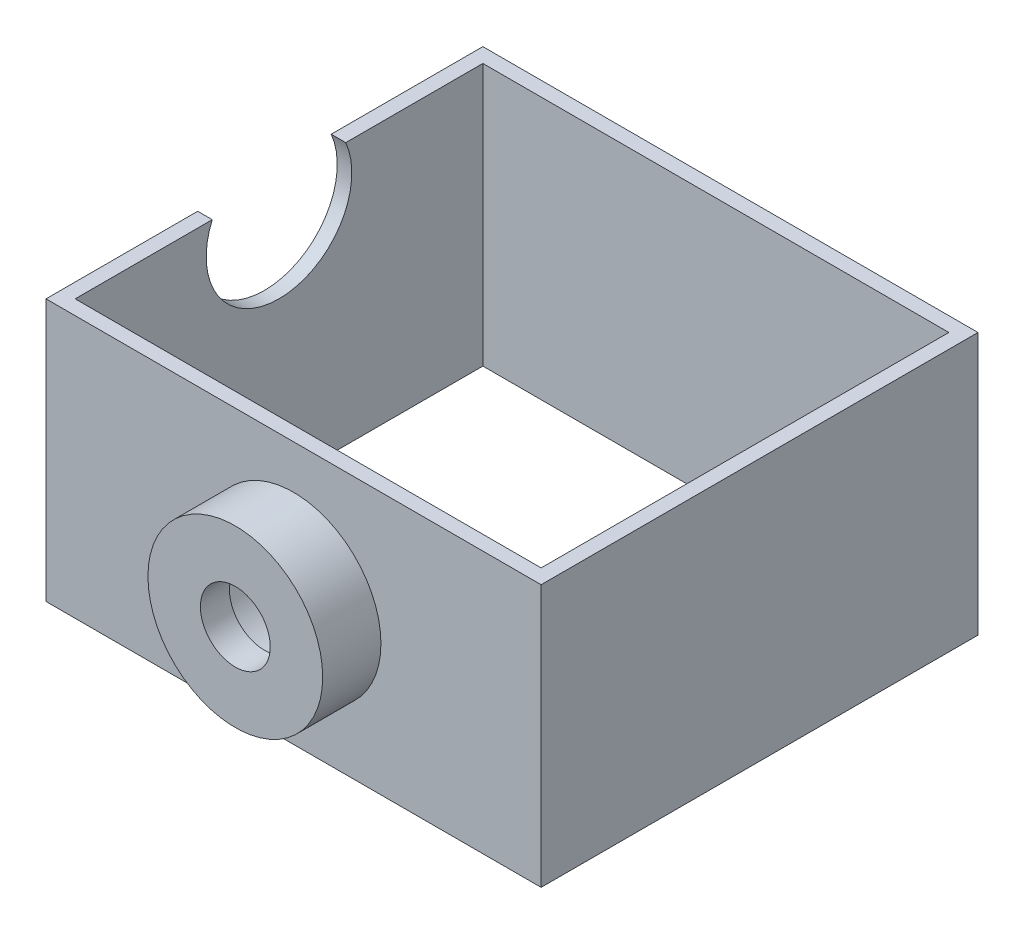
ISO-10303-21;
HEADER;
FILE_DESCRIPTION(('STEP AP214'),'2;1');
FILE_NAME('part.step','',(''),(''),'','','');
FILE_SCHEMA(('AUTOMOTIVE_DESIGN { 1 0 10303 214 1 1 1 1 }'));
ENDSEC;
DATA;
#1=APPLICATION_CONTEXT('core data for automotive mechanical design processes');
#2=APPLICATION_PROTOCOL_DEFINITION('international standard','automotive_design',2000,#1);
#3=PRODUCT_CONTEXT('',#1,'mechanical');
#4=PRODUCT('Part','Part','',(#3));
#5=PRODUCT_RELATED_PRODUCT_CATEGORY('part','',(#4));
#6=PRODUCT_DEFINITION_FORMATION('','',#4);
#7=PRODUCT_DEFINITION_CONTEXT('part definition',#1,'design');
#8=PRODUCT_DEFINITION('design','',#6,#7);
#9=PRODUCT_DEFINITION_SHAPE('','',#8);
#10=(LENGTH_UNIT() NAMED_UNIT(*) SI_UNIT(.MILLI.,.METRE.));
#11=(NAMED_UNIT(*) PLANE_ANGLE_UNIT() SI_UNIT($,.RADIAN.));
#12=(NAMED_UNIT(*) SI_UNIT($,.STERADIAN.) SOLID_ANGLE_UNIT());
#13=UNCERTAINTY_MEASURE_WITH_UNIT(LENGTH_MEASURE(1.E-05),#10,'distance_accuracy_value','');
#14=(GEOMETRIC_REPRESENTATION_CONTEXT(3) GLOBAL_UNCERTAINTY_ASSIGNED_CONTEXT((#13)) GLOBAL_UNIT_ASSIGNED_CONTEXT((#10,
#11,#12)) REPRESENTATION_CONTEXT('',''));
#15=CARTESIAN_POINT('',(0.,0.,0.));
#16=DIRECTION('',(0.,0.,1.));
#17=DIRECTION('',(1.,0.,0.));
#18=AXIS2_PLACEMENT_3D('',#15,#16,#17);
#19=CARTESIAN_POINT('',(0.,0.,-75.001));
#20=DIRECTION('',(0.,0.,1.));
#21=DIRECTION('',(1.,0.,0.));
#22=AXIS2_PLACEMENT_3D('',#19,#20,#21);
#23=CYLINDRICAL_SURFACE('',#22,6.);
#24=CARTESIAN_POINT('',(0.,0.,10.));
#25=DIRECTION('',(0.,0.,1.));
#26=DIRECTION('',(1.,0.,0.));
#27=AXIS2_PLACEMENT_3D('',#24,#25,#26);
#28=CIRCLE('',#27,6.);
#29=CARTESIAN_POINT('',(6.,0.,10.));
#30=VERTEX_POINT('',#29);
#31=EDGE_CURVE('E212',#30,#30,#28,.T.);
#32=ORIENTED_EDGE('',*,*,#31,.T.);
#33=EDGE_LOOP('',(#32));
#34=FACE_BOUND('',#33,.T.);
#35=CARTESIAN_POINT('',(0.,0.,5.00000000000002));
#36=DIRECTION('',(0.,0.,-1.));
#37=DIRECTION('',(-1.,0.,0.));
#38=AXIS2_PLACEMENT_3D('',#35,#36,#37);
#39=CIRCLE('',#38,6.);
#40=CARTESIAN_POINT('',(-6.,0.,5.00000000000002));
#41=VERTEX_POINT('',#40);
#42=EDGE_CURVE('E37',#41,#41,#39,.F.);
#43=ORIENTED_EDGE('',*,*,#42,.F.);
#44=EDGE_LOOP('',(#43));
#45=FACE_BOUND('',#44,.T.);
#46=ADVANCED_FACE('F33',(#34,#45),#23,.F.);
#47=CARTESIAN_POINT('',(0.,0.,10.));
#48=DIRECTION('',(0.,0.,-1.));
#49=DIRECTION('',(-1.,0.,0.));
#50=AXIS2_PLACEMENT_3D('',#47,#48,#49);
#51=CYLINDRICAL_SURFACE('',#50,15.);
#52=CARTESIAN_POINT('',(0.,0.,10.));
#53=DIRECTION('',(0.,0.,1.));
#54=DIRECTION('',(1.,0.,0.));
#55=AXIS2_PLACEMENT_3D('',#52,#53,#54);
#56=CIRCLE('',#55,15.);
#57=CARTESIAN_POINT('',(15.,0.,10.));
#58=VERTEX_POINT('',#57);
#59=EDGE_CURVE('E11',#58,#58,#56,.T.);
#60=ORIENTED_EDGE('',*,*,#59,.F.);
#61=EDGE_LOOP('',(#60));
#62=FACE_BOUND('',#61,.T.);
#63=CARTESIAN_POINT('',(0.,0.,0.));
#64=DIRECTION('',(0.,0.,1.));
#65=DIRECTION('',(1.,0.,0.));
#66=AXIS2_PLACEMENT_3D('',#63,#64,#65);
#67=CIRCLE('',#66,15.);
#68=CARTESIAN_POINT('',(15.,0.,0.));
#69=VERTEX_POINT('',#68);
#70=EDGE_CURVE('E42',#69,#69,#67,.T.);
#71=ORIENTED_EDGE('',*,*,#70,.T.);
#72=EDGE_LOOP('',(#71));
#73=FACE_BOUND('',#72,.T.);
#74=ADVANCED_FACE('F35',(#62,#73),#51,.T.);
#75=CARTESIAN_POINT('',(0.,0.,10.));
#76=DIRECTION('',(0.,0.,1.));
#77=DIRECTION('',(1.,0.,0.));
#78=AXIS2_PLACEMENT_3D('',#75,#76,#77);
#79=PLANE('',#78);
#80=ORIENTED_EDGE('',*,*,#31,.F.);
#81=EDGE_LOOP('',(#80));
#82=FACE_BOUND('',#81,.T.);
#83=ORIENTED_EDGE('',*,*,#59,.T.);
#84=EDGE_LOOP('',(#83));
#85=FACE_BOUND('',#84,.T.);
#86=ADVANCED_FACE('F253',(#82,#85),#79,.T.);
#87=CARTESIAN_POINT('',(-42.5,-22.5,-75.));
#88=DIRECTION('',(1.,0.,0.));
#89=DIRECTION('',(0.,0.,-1.));
#90=AXIS2_PLACEMENT_3D('',#87,#88,#89);
#91=PLANE('',#90);
#92=DIRECTION('',(0.,0.,1.));
#93=VECTOR('',#92,1.);
#94=CARTESIAN_POINT('',(-42.5,22.5,-75.));
#95=LINE('',#94,#93);
#96=CARTESIAN_POINT('',(-42.5,22.5,-26.0435607626104));
#97=VERTEX_POINT('',#96);
#98=CARTESIAN_POINT('',(-42.5,22.5,0.));
#99=VERTEX_POINT('',#98);
#100=EDGE_CURVE('E122',#97,#99,#95,.T.);
#101=ORIENTED_EDGE('',*,*,#100,.F.);
#102=CARTESIAN_POINT('',(-42.5,17.5,-37.5));
#103=DIRECTION('',(-1.,0.,0.));
#104=DIRECTION('',(0.,0.,1.));
#105=AXIS2_PLACEMENT_3D('',#102,#103,#104);
#106=CIRCLE('',#105,12.5);
#107=CARTESIAN_POINT('',(-42.5,22.5,-48.9564392373896));
#108=VERTEX_POINT('',#107);
#109=EDGE_CURVE('E110',#108,#97,#106,.T.);
#110=ORIENTED_EDGE('',*,*,#109,.F.);
#111=CARTESIAN_POINT('',(-42.5,22.5,-75.));
#112=VERTEX_POINT('',#111);
#113=EDGE_CURVE('E131',#112,#108,#95,.T.);
#114=ORIENTED_EDGE('',*,*,#113,.F.);
#115=DIRECTION('',(0.,1.,0.));
#116=VECTOR('',#115,1.);
#117=CARTESIAN_POINT('',(-42.5,-22.5,-75.));
#118=LINE('',#117,#116);
#119=CARTESIAN_POINT('',(-42.5,-22.5,-75.));
#120=VERTEX_POINT('',#119);
#121=EDGE_CURVE('E165',#120,#112,#118,.T.);
#122=ORIENTED_EDGE('',*,*,#121,.F.);
#123=DIRECTION('',(0.,0.,1.));
#124=VECTOR('',#123,1.);
#125=CARTESIAN_POINT('',(-42.5,-22.5,-75.));
#126=LINE('',#125,#124);
#127=CARTESIAN_POINT('',(-42.5,-22.5,0.));
#128=VERTEX_POINT('',#127);
#129=EDGE_CURVE('E166',#120,#128,#126,.T.);
#130=ORIENTED_EDGE('',*,*,#129,.T.);
#131=DIRECTION('',(0.,1.,0.));
#132=VECTOR('',#131,1.);
#133=CARTESIAN_POINT('',(-42.5,-22.5,0.));
#134=LINE('',#133,#132);
#135=EDGE_CURVE('E130',#128,#99,#134,.T.);
#136=ORIENTED_EDGE('',*,*,#135,.T.);
#137=EDGE_LOOP('',(#101,#110,#114,#122,#130,#136));
#138=FACE_BOUND('',#137,.T.);
#139=ADVANCED_FACE('F127',(#138),#91,.F.);
#140=CARTESIAN_POINT('',(42.5,22.5,-75.));
#141=DIRECTION('',(0.,-1.,0.));
#142=DIRECTION('',(0.,0.,-1.));
#143=AXIS2_PLACEMENT_3D('',#140,#141,#142);
#144=PLANE('',#143);
#145=DIRECTION('',(0.,0.,1.));
#146=VECTOR('',#145,1.);
#147=CARTESIAN_POINT('',(-40.,22.5,-2.49999999999997));
#148=LINE('',#147,#146);
#149=CARTESIAN_POINT('',(-40.,22.5,-26.0435607626104));
#150=VERTEX_POINT('',#149);
#151=CARTESIAN_POINT('',(-40.,22.5,-2.49999999999998));
#152=VERTEX_POINT('',#151);
#153=EDGE_CURVE('E57',#150,#152,#148,.T.);
#154=ORIENTED_EDGE('',*,*,#153,.F.);
#155=DIRECTION('',(-1.,0.,0.));
#156=VECTOR('',#155,1.);
#157=CARTESIAN_POINT('',(42.501,22.5,-26.0435607626104));
#158=LINE('',#157,#156);
#159=EDGE_CURVE('E50',#97,#150,#158,.F.);
#160=ORIENTED_EDGE('',*,*,#159,.F.);
#161=ORIENTED_EDGE('',*,*,#100,.T.);
#162=DIRECTION('',(1.,0.,0.));
#163=VECTOR('',#162,1.);
#164=CARTESIAN_POINT('',(42.5,22.5,0.));
#165=LINE('',#164,#163);
#166=CARTESIAN_POINT('',(42.5,22.5,0.));
#167=VERTEX_POINT('',#166);
#168=EDGE_CURVE('E151',#99,#167,#165,.T.);
#169=ORIENTED_EDGE('',*,*,#168,.T.);
#170=DIRECTION('',(0.,0.,1.));
#171=VECTOR('',#170,1.);
#172=CARTESIAN_POINT('',(42.5,22.5,-75.));
#173=LINE('',#172,#171);
#174=CARTESIAN_POINT('',(42.5,22.5,-75.));
#175=VERTEX_POINT('',#174);
#176=EDGE_CURVE('E132',#175,#167,#173,.T.);
#177=ORIENTED_EDGE('',*,*,#176,.F.);
#178=DIRECTION('',(1.,0.,0.));
#179=VECTOR('',#178,1.);
#180=CARTESIAN_POINT('',(42.5,22.5,-75.));
#181=LINE('',#180,#179);
#182=EDGE_CURVE('E178',#112,#175,#181,.T.);
#183=ORIENTED_EDGE('',*,*,#182,.F.);
#184=ORIENTED_EDGE('',*,*,#113,.T.);
#185=DIRECTION('',(-1.,0.,0.));
#186=VECTOR('',#185,1.);
#187=CARTESIAN_POINT('',(42.501,22.5,-48.9564392373896));
#188=LINE('',#187,#186);
#189=CARTESIAN_POINT('',(-40.,22.5,-48.9564392373896));
#190=VERTEX_POINT('',#189);
#191=EDGE_CURVE('E113',#190,#108,#188,.T.);
#192=ORIENTED_EDGE('',*,*,#191,.F.);
#193=CARTESIAN_POINT('',(-40.,22.5,-72.5));
#194=VERTEX_POINT('',#193);
#195=EDGE_CURVE('E201',#194,#190,#148,.T.);
#196=ORIENTED_EDGE('',*,*,#195,.F.);
#197=DIRECTION('',(-1.,0.,0.));
#198=VECTOR('',#197,1.);
#199=CARTESIAN_POINT('',(40.,22.5,-72.5));
#200=LINE('',#199,#198);
#201=CARTESIAN_POINT('',(40.,22.5,-72.5));
#202=VERTEX_POINT('',#201);
#203=EDGE_CURVE('E188',#202,#194,#200,.T.);
#204=ORIENTED_EDGE('',*,*,#203,.F.);
#205=DIRECTION('',(0.,0.,-1.));
#206=VECTOR('',#205,1.);
#207=CARTESIAN_POINT('',(40.,22.5,-2.49999999999998));
#208=LINE('',#207,#206);
#209=CARTESIAN_POINT('',(40.,22.5,-2.49999999999998));
#210=VERTEX_POINT('',#209);
#211=EDGE_CURVE('E195',#210,#202,#208,.T.);
#212=ORIENTED_EDGE('',*,*,#211,.F.);
#213=DIRECTION('',(1.,0.,0.));
#214=VECTOR('',#213,1.);
#215=CARTESIAN_POINT('',(40.,22.5,-2.49999999999998));
#216=LINE('',#215,#214);
#217=EDGE_CURVE('E198',#152,#210,#216,.T.);
#218=ORIENTED_EDGE('',*,*,#217,.F.);
#219=EDGE_LOOP('',(#154,#160,#161,#169,#177,#183,#184,#192,#196,#204,#212,#218));
#220=FACE_BOUND('',#219,.T.);
#221=ADVANCED_FACE('F121',(#220),#144,.F.);
#222=CARTESIAN_POINT('',(42.5,-22.5,-75.));
#223=DIRECTION('',(-1.,0.,0.));
#224=DIRECTION('',(0.,0.,1.));
#225=AXIS2_PLACEMENT_3D('',#222,#223,#224);
#226=PLANE('',#225);
#227=DIRECTION('',(0.,-1.,0.));
#228=VECTOR('',#227,1.);
#229=CARTESIAN_POINT('',(42.5,-22.5,0.));
#230=LINE('',#229,#228);
#231=CARTESIAN_POINT('',(42.5,-22.5,0.));
#232=VERTEX_POINT('',#231);
#233=EDGE_CURVE('E154',#167,#232,#230,.T.);
#234=ORIENTED_EDGE('',*,*,#233,.T.);
#235=DIRECTION('',(0.,0.,1.));
#236=VECTOR('',#235,1.);
#237=CARTESIAN_POINT('',(42.5,-22.5,-75.));
#238=LINE('',#237,#236);
#239=CARTESIAN_POINT('',(42.5,-22.5,-75.));
#240=VERTEX_POINT('',#239);
#241=EDGE_CURVE('E135',#240,#232,#238,.T.);
#242=ORIENTED_EDGE('',*,*,#241,.F.);
#243=DIRECTION('',(0.,-1.,0.));
#244=VECTOR('',#243,1.);
#245=CARTESIAN_POINT('',(42.5,-22.5,-75.));
#246=LINE('',#245,#244);
#247=EDGE_CURVE('E176',#175,#240,#246,.T.);
#248=ORIENTED_EDGE('',*,*,#247,.F.);
#249=ORIENTED_EDGE('',*,*,#176,.T.);
#250=EDGE_LOOP('',(#234,#242,#248,#249));
#251=FACE_BOUND('',#250,.T.);
#252=ADVANCED_FACE('F175',(#251),#226,.F.);
#253=CARTESIAN_POINT('',(42.5,-22.5,-75.));
#254=DIRECTION('',(0.,1.,0.));
#255=DIRECTION('',(0.,0.,1.));
#256=AXIS2_PLACEMENT_3D('',#253,#254,#255);
#257=PLANE('',#256);
#258=DIRECTION('',(1.,0.,0.));
#259=VECTOR('',#258,1.);
#260=CARTESIAN_POINT('',(40.,-22.5,-72.5));
#261=LINE('',#260,#259);
#262=CARTESIAN_POINT('',(-40.,-22.5,-72.5));
#263=VERTEX_POINT('',#262);
#264=CARTESIAN_POINT('',(40.,-22.5,-72.5));
#265=VERTEX_POINT('',#264);
#266=EDGE_CURVE('E207',#263,#265,#261,.T.);
#267=ORIENTED_EDGE('',*,*,#266,.F.);
#268=DIRECTION('',(0.,0.,-1.));
#269=VECTOR('',#268,1.);
#270=CARTESIAN_POINT('',(-40.,-22.5,-2.49999999999997));
#271=LINE('',#270,#269);
#272=CARTESIAN_POINT('',(-40.,-22.5,-2.49999999999997));
#273=VERTEX_POINT('',#272);
#274=EDGE_CURVE('E204',#273,#263,#271,.T.);
#275=ORIENTED_EDGE('',*,*,#274,.F.);
#276=DIRECTION('',(-1.,0.,0.));
#277=VECTOR('',#276,1.);
#278=CARTESIAN_POINT('',(40.,-22.5,-2.49999999999998));
#279=LINE('',#278,#277);
#280=CARTESIAN_POINT('',(40.,-22.5,-2.49999999999999));
#281=VERTEX_POINT('',#280);
#282=EDGE_CURVE('E152',#281,#273,#279,.T.);
#283=ORIENTED_EDGE('',*,*,#282,.F.);
#284=DIRECTION('',(0.,0.,1.));
#285=VECTOR('',#284,1.);
#286=CARTESIAN_POINT('',(40.,-22.5,-2.49999999999998));
#287=LINE('',#286,#285);
#288=EDGE_CURVE('E210',#265,#281,#287,.T.);
#289=ORIENTED_EDGE('',*,*,#288,.F.);
#290=EDGE_LOOP('',(#267,#275,#283,#289));
#291=FACE_BOUND('',#290,.T.);
#292=DIRECTION('',(-1.,0.,0.));
#293=VECTOR('',#292,1.);
#294=CARTESIAN_POINT('',(42.5,-22.5,0.));
#295=LINE('',#294,#293);
#296=EDGE_CURVE('E150',#232,#128,#295,.T.);
#297=ORIENTED_EDGE('',*,*,#296,.T.);
#298=ORIENTED_EDGE('',*,*,#129,.F.);
#299=DIRECTION('',(-1.,0.,0.));
#300=VECTOR('',#299,1.);
#301=CARTESIAN_POINT('',(42.5,-22.5,-75.));
#302=LINE('',#301,#300);
#303=EDGE_CURVE('E160',#240,#120,#302,.T.);
#304=ORIENTED_EDGE('',*,*,#303,.F.);
#305=ORIENTED_EDGE('',*,*,#241,.T.);
#306=EDGE_LOOP('',(#297,#298,#304,#305));
#307=FACE_BOUND('',#306,.T.);
#308=ADVANCED_FACE('F171',(#291,#307),#257,.F.);
#309=CARTESIAN_POINT('',(0.,0.,-75.));
#310=DIRECTION('',(0.,0.,1.));
#311=DIRECTION('',(1.,0.,0.));
#312=AXIS2_PLACEMENT_3D('',#309,#310,#311);
#313=PLANE('',#312);
#314=ORIENTED_EDGE('',*,*,#121,.T.);
#315=ORIENTED_EDGE('',*,*,#182,.T.);
#316=ORIENTED_EDGE('',*,*,#247,.T.);
#317=ORIENTED_EDGE('',*,*,#303,.T.);
#318=EDGE_LOOP('',(#314,#315,#316,#317));
#319=FACE_BOUND('',#318,.T.);
#320=ADVANCED_FACE('F146',(#319),#313,.F.);
#321=CARTESIAN_POINT('',(0.,0.,0.));
#322=DIRECTION('',(0.,0.,1.));
#323=DIRECTION('',(1.,0.,0.));
#324=AXIS2_PLACEMENT_3D('',#321,#322,#323);
#325=PLANE('',#324);
#326=ORIENTED_EDGE('',*,*,#70,.F.);
#327=EDGE_LOOP('',(#326));
#328=FACE_BOUND('',#327,.T.);
#329=ORIENTED_EDGE('',*,*,#135,.F.);
#330=ORIENTED_EDGE('',*,*,#296,.F.);
#331=ORIENTED_EDGE('',*,*,#233,.F.);
#332=ORIENTED_EDGE('',*,*,#168,.F.);
#333=EDGE_LOOP('',(#329,#330,#331,#332));
#334=FACE_BOUND('',#333,.T.);
#335=ADVANCED_FACE('F142',(#328,#334),#325,.T.);
#336=CARTESIAN_POINT('',(-40.,-22.501,-2.49999999999997));
#337=DIRECTION('',(-1.,0.,0.));
#338=DIRECTION('',(0.,0.,1.));
#339=AXIS2_PLACEMENT_3D('',#336,#337,#338);
#340=PLANE('',#339);
#341=ORIENTED_EDGE('',*,*,#195,.T.);
#342=CARTESIAN_POINT('',(-40.,17.5,-37.5));
#343=DIRECTION('',(-1.,0.,0.));
#344=DIRECTION('',(0.,0.,1.));
#345=AXIS2_PLACEMENT_3D('',#342,#343,#344);
#346=CIRCLE('',#345,12.5);
#347=EDGE_CURVE('E118',#150,#190,#346,.F.);
#348=ORIENTED_EDGE('',*,*,#347,.F.);
#349=ORIENTED_EDGE('',*,*,#153,.T.);
#350=DIRECTION('',(0.,1.,0.));
#351=VECTOR('',#350,1.);
#352=CARTESIAN_POINT('',(-40.,-22.501,-2.49999999999997));
#353=LINE('',#352,#351);
#354=EDGE_CURVE('E185',#273,#152,#353,.T.);
#355=ORIENTED_EDGE('',*,*,#354,.F.);
#356=ORIENTED_EDGE('',*,*,#274,.T.);
#357=DIRECTION('',(0.,1.,0.));
#358=VECTOR('',#357,1.);
#359=CARTESIAN_POINT('',(-40.,-22.501,-72.5));
#360=LINE('',#359,#358);
#361=EDGE_CURVE('E157',#263,#194,#360,.T.);
#362=ORIENTED_EDGE('',*,*,#361,.T.);
#363=EDGE_LOOP('',(#341,#348,#349,#355,#356,#362));
#364=FACE_BOUND('',#363,.T.);
#365=ADVANCED_FACE('F145',(#364),#340,.F.);
#366=CARTESIAN_POINT('',(40.,-22.501,-72.5));
#367=DIRECTION('',(0.,0.,-1.));
#368=DIRECTION('',(-1.,0.,0.));
#369=AXIS2_PLACEMENT_3D('',#366,#367,#368);
#370=PLANE('',#369);
#371=ORIENTED_EDGE('',*,*,#266,.T.);
#372=DIRECTION('',(0.,1.,0.));
#373=VECTOR('',#372,1.);
#374=CARTESIAN_POINT('',(40.,-22.501,-72.5));
#375=LINE('',#374,#373);
#376=EDGE_CURVE('E190',#265,#202,#375,.T.);
#377=ORIENTED_EDGE('',*,*,#376,.T.);
#378=ORIENTED_EDGE('',*,*,#203,.T.);
#379=ORIENTED_EDGE('',*,*,#361,.F.);
#380=EDGE_LOOP('',(#371,#377,#378,#379));
#381=FACE_BOUND('',#380,.T.);
#382=ADVANCED_FACE('F227',(#381),#370,.F.);
#383=CARTESIAN_POINT('',(40.,-22.501,-2.49999999999998));
#384=DIRECTION('',(1.,0.,0.));
#385=DIRECTION('',(0.,0.,-1.));
#386=AXIS2_PLACEMENT_3D('',#383,#384,#385);
#387=PLANE('',#386);
#388=ORIENTED_EDGE('',*,*,#288,.T.);
#389=DIRECTION('',(0.,1.,0.));
#390=VECTOR('',#389,1.);
#391=CARTESIAN_POINT('',(40.,-22.501,-2.49999999999998));
#392=LINE('',#391,#390);
#393=EDGE_CURVE('E187',#281,#210,#392,.T.);
#394=ORIENTED_EDGE('',*,*,#393,.T.);
#395=ORIENTED_EDGE('',*,*,#211,.T.);
#396=ORIENTED_EDGE('',*,*,#376,.F.);
#397=EDGE_LOOP('',(#388,#394,#395,#396));
#398=FACE_BOUND('',#397,.T.);
#399=ADVANCED_FACE('F230',(#398),#387,.F.);
#400=CARTESIAN_POINT('',(40.,-22.501,-2.49999999999998));
#401=DIRECTION('',(0.,0.,1.));
#402=DIRECTION('',(1.,0.,0.));
#403=AXIS2_PLACEMENT_3D('',#400,#401,#402);
#404=PLANE('',#403);
#405=CARTESIAN_POINT('',(0.,0.,-2.49999999999998));
#406=DIRECTION('',(0.,0.,-1.));
#407=DIRECTION('',(-1.,0.,0.));
#408=AXIS2_PLACEMENT_3D('',#405,#406,#407);
#409=CIRCLE('',#408,10.);
#410=CARTESIAN_POINT('',(-10.,0.,-2.49999999999998));
#411=VERTEX_POINT('',#410);
#412=EDGE_CURVE('E215',#411,#411,#409,.T.);
#413=ORIENTED_EDGE('',*,*,#412,.F.);
#414=EDGE_LOOP('',(#413));
#415=FACE_BOUND('',#414,.T.);
#416=ORIENTED_EDGE('',*,*,#282,.T.);
#417=ORIENTED_EDGE('',*,*,#354,.T.);
#418=ORIENTED_EDGE('',*,*,#217,.T.);
#419=ORIENTED_EDGE('',*,*,#393,.F.);
#420=EDGE_LOOP('',(#416,#417,#418,#419));
#421=FACE_BOUND('',#420,.T.);
#422=ADVANCED_FACE('F235',(#415,#421),#404,.F.);
#423=CARTESIAN_POINT('',(0.,0.,5.00000000000002));
#424=DIRECTION('',(0.,0.,-1.));
#425=DIRECTION('',(-1.,0.,0.));
#426=AXIS2_PLACEMENT_3D('',#423,#424,#425);
#427=PLANE('',#426);
#428=CARTESIAN_POINT('',(0.,0.,5.00000000000002));
#429=DIRECTION('',(0.,0.,-1.));
#430=DIRECTION('',(-1.,0.,0.));
#431=AXIS2_PLACEMENT_3D('',#428,#429,#430);
#432=CIRCLE('',#431,10.);
#433=CARTESIAN_POINT('',(-10.,0.,5.00000000000002));
#434=VERTEX_POINT('',#433);
#435=EDGE_CURVE('E218',#434,#434,#432,.T.);
#436=ORIENTED_EDGE('',*,*,#435,.T.);
#437=EDGE_LOOP('',(#436));
#438=FACE_BOUND('',#437,.T.);
#439=ORIENTED_EDGE('',*,*,#42,.T.);
#440=EDGE_LOOP('',(#439));
#441=FACE_BOUND('',#440,.T.);
#442=ADVANCED_FACE('F266',(#438,#441),#427,.T.);
#443=CARTESIAN_POINT('',(0.,0.,5.00000000000002));
#444=DIRECTION('',(0.,0.,-1.));
#445=DIRECTION('',(-1.,0.,0.));
#446=AXIS2_PLACEMENT_3D('',#443,#444,#445);
#447=CYLINDRICAL_SURFACE('',#446,10.);
#448=ORIENTED_EDGE('',*,*,#435,.F.);
#449=EDGE_LOOP('',(#448));
#450=FACE_BOUND('',#449,.T.);
#451=ORIENTED_EDGE('',*,*,#412,.T.);
#452=EDGE_LOOP('',(#451));
#453=FACE_BOUND('',#452,.T.);
#454=ADVANCED_FACE('F258',(#450,#453),#447,.F.);
#455=CARTESIAN_POINT('',(42.501,17.5,-37.5));
#456=DIRECTION('',(-1.,0.,0.));
#457=DIRECTION('',(0.,0.,1.));
#458=AXIS2_PLACEMENT_3D('',#455,#456,#457);
#459=CYLINDRICAL_SURFACE('',#458,12.5);
#460=ORIENTED_EDGE('',*,*,#159,.T.);
#461=ORIENTED_EDGE('',*,*,#347,.T.);
#462=ORIENTED_EDGE('',*,*,#191,.T.);
#463=ORIENTED_EDGE('',*,*,#109,.T.);
#464=EDGE_LOOP('',(#460,#461,#462,#463));
#465=FACE_BOUND('',#464,.T.);
#466=ADVANCED_FACE('F111',(#465),#459,.F.);
#467=CLOSED_SHELL('',(#46,#74,#86,#139,#221,#252,#308,#320,#335,#365,#382,#399,#422,#442,#454,#466));
#468=MANIFOLD_SOLID_BREP('B2',#467);
#469=ADVANCED_BREP_SHAPE_REPRESENTATION('',(#18,#468),#14);
#470=SHAPE_DEFINITION_REPRESENTATION(#9,#469);
ENDSEC;
END-ISO-10303-21;
